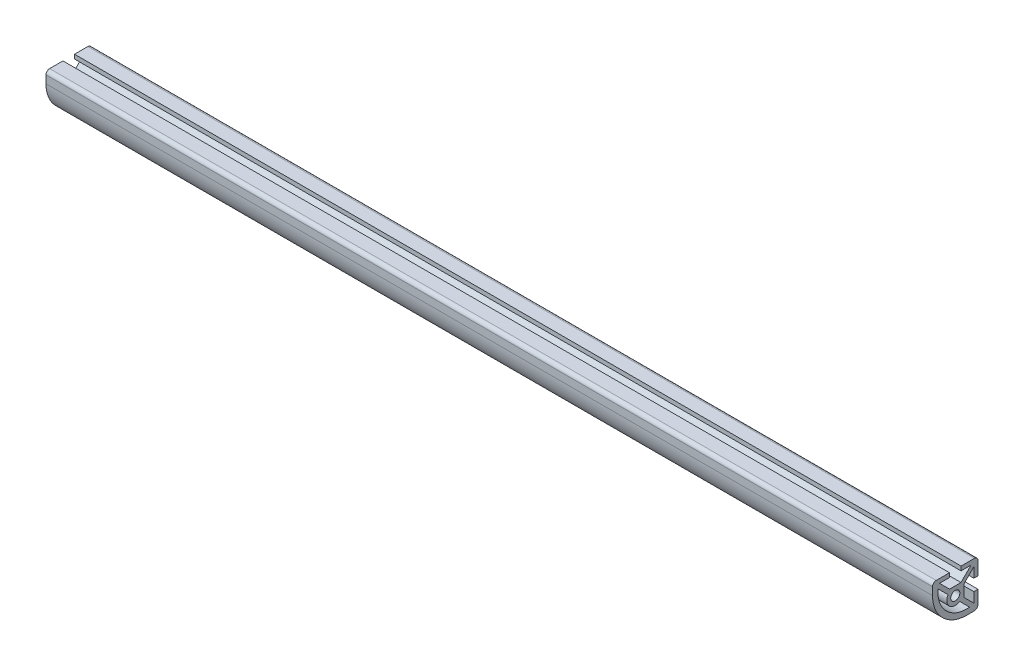
ISO-10303-21;
HEADER;
FILE_DESCRIPTION(('STEP AP214'),'2;1');
FILE_NAME('part.step','',(''),(''),'','','');
FILE_SCHEMA(('AUTOMOTIVE_DESIGN { 1 0 10303 214 1 1 1 1 }'));
ENDSEC;
DATA;
#1=APPLICATION_CONTEXT('core data for automotive mechanical design processes');
#2=APPLICATION_PROTOCOL_DEFINITION('international standard','automotive_design',2000,#1);
#3=PRODUCT_CONTEXT('',#1,'mechanical');
#4=PRODUCT('Part','Part','',(#3));
#5=PRODUCT_RELATED_PRODUCT_CATEGORY('part','',(#4));
#6=PRODUCT_DEFINITION_FORMATION('','',#4);
#7=PRODUCT_DEFINITION_CONTEXT('part definition',#1,'design');
#8=PRODUCT_DEFINITION('design','',#6,#7);
#9=PRODUCT_DEFINITION_SHAPE('','',#8);
#10=(LENGTH_UNIT() NAMED_UNIT(*) SI_UNIT(.MILLI.,.METRE.));
#11=(NAMED_UNIT(*) PLANE_ANGLE_UNIT() SI_UNIT($,.RADIAN.));
#12=(NAMED_UNIT(*) SI_UNIT($,.STERADIAN.) SOLID_ANGLE_UNIT());
#13=UNCERTAINTY_MEASURE_WITH_UNIT(LENGTH_MEASURE(1.E-05),#10,'distance_accuracy_value','');
#14=(GEOMETRIC_REPRESENTATION_CONTEXT(3) GLOBAL_UNCERTAINTY_ASSIGNED_CONTEXT((#13)) GLOBAL_UNIT_ASSIGNED_CONTEXT((#10,
#11,#12)) REPRESENTATION_CONTEXT('',''));
#15=CARTESIAN_POINT('',(0.,0.,0.));
#16=DIRECTION('',(0.,0.,1.));
#17=DIRECTION('',(1.,0.,0.));
#18=AXIS2_PLACEMENT_3D('',#15,#16,#17);
#19=CARTESIAN_POINT('',(247.65,10.668,10.6679999999999));
#20=DIRECTION('',(-1.,0.,0.));
#21=DIRECTION('',(0.,0.,1.));
#22=AXIS2_PLACEMENT_3D('',#19,#20,#21);
#23=PLANE('',#22);
#24=CARTESIAN_POINT('',(247.65,10.668,10.6679999999999));
#25=DIRECTION('',(1.,0.,0.));
#26=DIRECTION('',(0.,0.,1.));
#27=AXIS2_PLACEMENT_3D('',#24,#25,#26);
#28=CIRCLE('',#27,2.03200000000002);
#29=CARTESIAN_POINT('',(247.65,12.7,10.6679999999999));
#30=VERTEX_POINT('',#29);
#31=CARTESIAN_POINT('',(247.65,10.668,12.6999999999999));
#32=VERTEX_POINT('',#31);
#33=EDGE_CURVE('E228',#30,#32,#28,.T.);
#34=ORIENTED_EDGE('',*,*,#33,.T.);
#35=DIRECTION('',(0.,-1.,0.));
#36=VECTOR('',#35,1.);
#37=CARTESIAN_POINT('',(247.65,10.668,12.6999999999999));
#38=LINE('',#37,#36);
#39=CARTESIAN_POINT('',(247.65,6.35000000000034,12.6999999999999));
#40=VERTEX_POINT('',#39);
#41=EDGE_CURVE('E337',#32,#40,#38,.T.);
#42=ORIENTED_EDGE('',*,*,#41,.T.);
#43=CARTESIAN_POINT('',(247.65,6.35,-6.35000000000011));
#44=DIRECTION('',(1.,0.,0.));
#45=DIRECTION('',(0.,0.,-1.));
#46=AXIS2_PLACEMENT_3D('',#43,#44,#45);
#47=CIRCLE('',#46,19.05);
#48=CARTESIAN_POINT('',(247.65,-12.7,-6.35000000000012));
#49=VERTEX_POINT('',#48);
#50=EDGE_CURVE('E339',#40,#49,#47,.T.);
#51=ORIENTED_EDGE('',*,*,#50,.T.);
#52=DIRECTION('',(0.,0.,-1.));
#53=VECTOR('',#52,1.);
#54=CARTESIAN_POINT('',(247.65,-12.7,-10.6679999999999));
#55=LINE('',#54,#53);
#56=CARTESIAN_POINT('',(247.65,-12.7,-10.6679999999999));
#57=VERTEX_POINT('',#56);
#58=EDGE_CURVE('E341',#49,#57,#55,.T.);
#59=ORIENTED_EDGE('',*,*,#58,.T.);
#60=CARTESIAN_POINT('',(247.65,-10.668,-10.6679999999999));
#61=DIRECTION('',(1.,0.,0.));
#62=DIRECTION('',(0.,0.,1.));
#63=AXIS2_PLACEMENT_3D('',#60,#61,#62);
#64=CIRCLE('',#63,2.03200000000001);
#65=CARTESIAN_POINT('',(247.65,-10.668,-12.6999999999999));
#66=VERTEX_POINT('',#65);
#67=EDGE_CURVE('E343',#57,#66,#64,.T.);
#68=ORIENTED_EDGE('',*,*,#67,.T.);
#69=DIRECTION('',(0.,1.,0.));
#70=VECTOR('',#69,1.);
#71=CARTESIAN_POINT('',(247.65,-3.23850000000069,-12.6999999999999));
#72=LINE('',#71,#70);
#73=CARTESIAN_POINT('',(247.65,-3.23850000000069,-12.6999999999999));
#74=VERTEX_POINT('',#73);
#75=EDGE_CURVE('E345',#66,#74,#72,.T.);
#76=ORIENTED_EDGE('',*,*,#75,.T.);
#77=DIRECTION('',(0.,0.,1.));
#78=VECTOR('',#77,1.);
#79=CARTESIAN_POINT('',(247.65,-3.23850000000054,-10.3632000000016));
#80=LINE('',#79,#78);
#81=CARTESIAN_POINT('',(247.65,-3.23850000000054,-10.3632000000016));
#82=VERTEX_POINT('',#81);
#83=EDGE_CURVE('E347',#74,#82,#80,.T.);
#84=ORIENTED_EDGE('',*,*,#83,.T.);
#85=DIRECTION('',(0.,-1.,0.));
#86=VECTOR('',#85,1.);
#87=CARTESIAN_POINT('',(247.65,-8.80063543493584,-10.3632000000016));
#88=LINE('',#87,#86);
#89=CARTESIAN_POINT('',(247.65,-8.80063543493584,-10.3632000000016));
#90=VERTEX_POINT('',#89);
#91=EDGE_CURVE('E349',#82,#90,#88,.T.);
#92=ORIENTED_EDGE('',*,*,#91,.T.);
#93=DIRECTION('',(0.,0.707106781186543,0.707106781186552));
#94=VECTOR('',#93,1.);
#95=CARTESIAN_POINT('',(247.65,-3.18723566949115,-4.74980023455686));
#96=LINE('',#95,#94);
#97=CARTESIAN_POINT('',(247.65,-3.18723566949115,-4.74980023455686));
#98=VERTEX_POINT('',#97);
#99=EDGE_CURVE('E351',#90,#98,#96,.T.);
#100=ORIENTED_EDGE('',*,*,#99,.T.);
#101=DIRECTION('',(0.,1.,0.));
#102=VECTOR('',#101,1.);
#103=CARTESIAN_POINT('',(247.65,3.18723566949115,-4.74980023455665));
#104=LINE('',#103,#102);
#105=CARTESIAN_POINT('',(247.65,3.18723566949115,-4.74980023455665));
#106=VERTEX_POINT('',#105);
#107=EDGE_CURVE('E353',#98,#106,#104,.T.);
#108=ORIENTED_EDGE('',*,*,#107,.T.);
#109=DIRECTION('',(0.,0.707106781186543,-0.707106781186552));
#110=VECTOR('',#109,1.);
#111=CARTESIAN_POINT('',(247.65,8.80063543493585,-10.3632000000014));
#112=LINE('',#111,#110);
#113=CARTESIAN_POINT('',(247.65,8.80063543493585,-10.3632000000014));
#114=VERTEX_POINT('',#113);
#115=EDGE_CURVE('E355',#106,#114,#112,.T.);
#116=ORIENTED_EDGE('',*,*,#115,.T.);
#117=DIRECTION('',(0.,-1.,0.));
#118=VECTOR('',#117,1.);
#119=CARTESIAN_POINT('',(247.65,3.23850000000055,-10.3632000000014));
#120=LINE('',#119,#118);
#121=CARTESIAN_POINT('',(247.65,3.23850000000055,-10.3632000000014));
#122=VERTEX_POINT('',#121);
#123=EDGE_CURVE('E357',#114,#122,#120,.T.);
#124=ORIENTED_EDGE('',*,*,#123,.T.);
#125=DIRECTION('',(0.,0.,-1.));
#126=VECTOR('',#125,1.);
#127=CARTESIAN_POINT('',(247.65,3.23850000000069,-12.7));
#128=LINE('',#127,#126);
#129=CARTESIAN_POINT('',(247.65,3.23850000000069,-12.7));
#130=VERTEX_POINT('',#129);
#131=EDGE_CURVE('E359',#122,#130,#128,.T.);
#132=ORIENTED_EDGE('',*,*,#131,.T.);
#133=DIRECTION('',(0.,1.,0.));
#134=VECTOR('',#133,1.);
#135=CARTESIAN_POINT('',(247.65,10.668,-12.7));
#136=LINE('',#135,#134);
#137=CARTESIAN_POINT('',(247.65,10.668,-12.7));
#138=VERTEX_POINT('',#137);
#139=EDGE_CURVE('E361',#130,#138,#136,.T.);
#140=ORIENTED_EDGE('',*,*,#139,.T.);
#141=CARTESIAN_POINT('',(247.65,10.668,-10.668));
#142=DIRECTION('',(1.,0.,0.));
#143=DIRECTION('',(0.,0.,1.));
#144=AXIS2_PLACEMENT_3D('',#141,#142,#143);
#145=CIRCLE('',#144,2.03200000000001);
#146=CARTESIAN_POINT('',(247.65,12.7,-10.668));
#147=VERTEX_POINT('',#146);
#148=EDGE_CURVE('E363',#138,#147,#145,.T.);
#149=ORIENTED_EDGE('',*,*,#148,.T.);
#150=DIRECTION('',(0.,0.,1.));
#151=VECTOR('',#150,1.);
#152=CARTESIAN_POINT('',(247.65,12.7,-3.23850000000062));
#153=LINE('',#152,#151);
#154=CARTESIAN_POINT('',(247.65,12.7,-3.23850000000062));
#155=VERTEX_POINT('',#154);
#156=EDGE_CURVE('E365',#147,#155,#153,.T.);
#157=ORIENTED_EDGE('',*,*,#156,.T.);
#158=DIRECTION('',(0.,-1.,0.));
#159=VECTOR('',#158,1.);
#160=CARTESIAN_POINT('',(247.65,10.3632000000014,-3.23850000000062));
#161=LINE('',#160,#159);
#162=CARTESIAN_POINT('',(247.65,10.3632000000014,-3.23850000000062));
#163=VERTEX_POINT('',#162);
#164=EDGE_CURVE('E367',#155,#163,#161,.T.);
#165=ORIENTED_EDGE('',*,*,#164,.T.);
#166=DIRECTION('',(0.,0.,-1.));
#167=VECTOR('',#166,1.);
#168=CARTESIAN_POINT('',(247.65,10.3632000000014,-8.80063543493592));
#169=LINE('',#168,#167);
#170=CARTESIAN_POINT('',(247.65,10.3632000000014,-8.80063543493592));
#171=VERTEX_POINT('',#170);
#172=EDGE_CURVE('E369',#163,#171,#169,.T.);
#173=ORIENTED_EDGE('',*,*,#172,.T.);
#174=DIRECTION('',(0.,-0.707106781186537,0.707106781186558));
#175=VECTOR('',#174,1.);
#176=CARTESIAN_POINT('',(247.65,4.74980023455676,-3.18723566949106));
#177=LINE('',#176,#175);
#178=CARTESIAN_POINT('',(247.65,4.74980023455676,-3.18723566949106));
#179=VERTEX_POINT('',#178);
#180=EDGE_CURVE('E371',#171,#179,#177,.T.);
#181=ORIENTED_EDGE('',*,*,#180,.T.);
#182=DIRECTION('',(0.,0.,1.));
#183=VECTOR('',#182,1.);
#184=CARTESIAN_POINT('',(247.65,4.74980023455676,3.18723566949115));
#185=LINE('',#184,#183);
#186=CARTESIAN_POINT('',(247.65,4.74980023455676,3.18723566949115));
#187=VERTEX_POINT('',#186);
#188=EDGE_CURVE('E373',#179,#187,#185,.T.);
#189=ORIENTED_EDGE('',*,*,#188,.T.);
#190=DIRECTION('',(0.,0.707106781186543,0.707106781186552));
#191=VECTOR('',#190,1.);
#192=CARTESIAN_POINT('',(247.65,10.3632000000014,8.80063543493592));
#193=LINE('',#192,#191);
#194=CARTESIAN_POINT('',(247.65,10.3632000000014,8.80063543493592));
#195=VERTEX_POINT('',#194);
#196=EDGE_CURVE('E375',#187,#195,#193,.T.);
#197=ORIENTED_EDGE('',*,*,#196,.T.);
#198=DIRECTION('',(0.,0.,-1.));
#199=VECTOR('',#198,1.);
#200=CARTESIAN_POINT('',(247.65,10.3632000000014,3.23850000000062));
#201=LINE('',#200,#199);
#202=CARTESIAN_POINT('',(247.65,10.3632000000014,3.23850000000062));
#203=VERTEX_POINT('',#202);
#204=EDGE_CURVE('E377',#195,#203,#201,.T.);
#205=ORIENTED_EDGE('',*,*,#204,.T.);
#206=DIRECTION('',(0.,1.,0.));
#207=VECTOR('',#206,1.);
#208=CARTESIAN_POINT('',(247.65,12.7,3.23850000000062));
#209=LINE('',#208,#207);
#210=CARTESIAN_POINT('',(247.65,12.7,3.23850000000062));
#211=VERTEX_POINT('',#210);
#212=EDGE_CURVE('E379',#203,#211,#209,.T.);
#213=ORIENTED_EDGE('',*,*,#212,.T.);
#214=DIRECTION('',(0.,0.,1.));
#215=VECTOR('',#214,1.);
#216=CARTESIAN_POINT('',(247.65,12.7,10.6679999999999));
#217=LINE('',#216,#215);
#218=EDGE_CURVE('E55',#211,#30,#217,.T.);
#219=ORIENTED_EDGE('',*,*,#218,.T.);
#220=EDGE_LOOP('',(#34,#42,#51,#59,#68,#76,#84,#92,#100,#108,#116,#124,#132,#140,#149,#157,#165,
#173,#181,#189,#197,#205,#213,#219));
#221=FACE_BOUND('',#220,.T.);
#222=CARTESIAN_POINT('',(247.65,0.,0.));
#223=DIRECTION('',(-1.,0.,0.));
#224=DIRECTION('',(0.,0.,-1.));
#225=AXIS2_PLACEMENT_3D('',#222,#223,#224);
#226=CIRCLE('',#225,4.74980023455676);
#227=CARTESIAN_POINT('',(247.65,-4.04776343648096,-2.48519887141517));
#228=VERTEX_POINT('',#227);
#229=CARTESIAN_POINT('',(247.65,2.48519887141525,4.04776343648091));
#230=VERTEX_POINT('',#229);
#231=EDGE_CURVE('E225',#228,#230,#226,.T.);
#232=ORIENTED_EDGE('',*,*,#231,.F.);
#233=DIRECTION('',(0.,0.707106781186554,0.707106781186541));
#234=VECTOR('',#233,1.);
#235=CARTESIAN_POINT('',(247.65,-4.04776343648096,-2.48519887141517));
#236=LINE('',#235,#234);
#237=CARTESIAN_POINT('',(247.65,-9.56631586282329,-8.00375129775741));
#238=VERTEX_POINT('',#237);
#239=EDGE_CURVE('E330',#238,#228,#236,.T.);
#240=ORIENTED_EDGE('',*,*,#239,.F.);
#241=CARTESIAN_POINT('',(247.65,6.34999999999999,-6.35000000000011));
#242=DIRECTION('',(1.,0.,0.));
#243=DIRECTION('',(0.,0.,-1.));
#244=AXIS2_PLACEMENT_3D('',#241,#242,#243);
#245=CIRCLE('',#244,16.0019999999998);
#246=CARTESIAN_POINT('',(247.65,8.00375129775759,9.56631586282315));
#247=VERTEX_POINT('',#246);
#248=EDGE_CURVE('E328',#247,#238,#245,.T.);
#249=ORIENTED_EDGE('',*,*,#248,.F.);
#250=DIRECTION('',(0.,0.707106781186554,0.707106781186541));
#251=VECTOR('',#250,1.);
#252=CARTESIAN_POINT('',(247.65,8.00375129775759,9.56631586282315));
#253=LINE('',#252,#251);
#254=EDGE_CURVE('E326',#230,#247,#253,.T.);
#255=ORIENTED_EDGE('',*,*,#254,.F.);
#256=EDGE_LOOP('',(#232,#240,#249,#255));
#257=FACE_BOUND('',#256,.T.);
#258=CARTESIAN_POINT('',(247.65,0.,0.));
#259=DIRECTION('',(1.,0.,0.));
#260=DIRECTION('',(0.,0.,-1.));
#261=AXIS2_PLACEMENT_3D('',#258,#259,#260);
#262=CIRCLE('',#261,2.55269999999991);
#263=CARTESIAN_POINT('',(247.65,0.,-2.55269999999991));
#264=VERTEX_POINT('',#263);
#265=EDGE_CURVE('E322',#264,#264,#262,.T.);
#266=ORIENTED_EDGE('',*,*,#265,.F.);
#267=EDGE_LOOP('',(#266));
#268=FACE_BOUND('',#267,.T.);
#269=ADVANCED_FACE('F32',(#221,#257,#268),#23,.F.);
#270=CARTESIAN_POINT('',(247.65,10.668,10.6679999999999));
#271=DIRECTION('',(-1.,0.,0.));
#272=DIRECTION('',(0.,0.,1.));
#273=AXIS2_PLACEMENT_3D('',#270,#271,#272);
#274=CYLINDRICAL_SURFACE('',#273,2.03200000000002);
#275=DIRECTION('',(-1.,0.,0.));
#276=VECTOR('',#275,1.);
#277=CARTESIAN_POINT('',(247.65,12.7,10.6679999999999));
#278=LINE('',#277,#276);
#279=CARTESIAN_POINT('',(-247.65,12.7,10.6679999999999));
#280=VERTEX_POINT('',#279);
#281=EDGE_CURVE('E382',#30,#280,#278,.T.);
#282=ORIENTED_EDGE('',*,*,#281,.T.);
#283=CARTESIAN_POINT('',(-247.65,10.668,10.6679999999999));
#284=DIRECTION('',(1.,0.,0.));
#285=DIRECTION('',(0.,0.,1.));
#286=AXIS2_PLACEMENT_3D('',#283,#284,#285);
#287=CIRCLE('',#286,2.03200000000002);
#288=CARTESIAN_POINT('',(-247.65,10.668,12.6999999999999));
#289=VERTEX_POINT('',#288);
#290=EDGE_CURVE('E250',#280,#289,#287,.T.);
#291=ORIENTED_EDGE('',*,*,#290,.T.);
#292=DIRECTION('',(-1.,0.,0.));
#293=VECTOR('',#292,1.);
#294=CARTESIAN_POINT('',(247.65,10.668,12.6999999999999));
#295=LINE('',#294,#293);
#296=EDGE_CURVE('E11',#32,#289,#295,.T.);
#297=ORIENTED_EDGE('',*,*,#296,.F.);
#298=ORIENTED_EDGE('',*,*,#33,.F.);
#299=EDGE_LOOP('',(#282,#291,#297,#298));
#300=FACE_BOUND('',#299,.T.);
#301=ADVANCED_FACE('F34',(#300),#274,.T.);
#302=CARTESIAN_POINT('',(247.65,10.668,12.6999999999999));
#303=DIRECTION('',(0.,0.,-1.));
#304=DIRECTION('',(-1.,0.,0.));
#305=AXIS2_PLACEMENT_3D('',#302,#303,#304);
#306=PLANE('',#305);
#307=ORIENTED_EDGE('',*,*,#296,.T.);
#308=DIRECTION('',(0.,-1.,0.));
#309=VECTOR('',#308,1.);
#310=CARTESIAN_POINT('',(-247.65,10.668,12.6999999999999));
#311=LINE('',#310,#309);
#312=CARTESIAN_POINT('',(-247.65,6.35000000000034,12.6999999999999));
#313=VERTEX_POINT('',#312);
#314=EDGE_CURVE('E253',#289,#313,#311,.T.);
#315=ORIENTED_EDGE('',*,*,#314,.T.);
#316=DIRECTION('',(-1.,0.,0.));
#317=VECTOR('',#316,1.);
#318=CARTESIAN_POINT('',(247.65,6.35000000000034,12.6999999999999));
#319=LINE('',#318,#317);
#320=EDGE_CURVE('E40',#40,#313,#319,.T.);
#321=ORIENTED_EDGE('',*,*,#320,.F.);
#322=ORIENTED_EDGE('',*,*,#41,.F.);
#323=EDGE_LOOP('',(#307,#315,#321,#322));
#324=FACE_BOUND('',#323,.T.);
#325=ADVANCED_FACE('F436',(#324),#306,.F.);
#326=CARTESIAN_POINT('',(247.65,6.35,-6.35000000000011));
#327=DIRECTION('',(-1.,0.,0.));
#328=DIRECTION('',(0.,0.,1.));
#329=AXIS2_PLACEMENT_3D('',#326,#327,#328);
#330=CYLINDRICAL_SURFACE('',#329,19.05);
#331=ORIENTED_EDGE('',*,*,#320,.T.);
#332=CARTESIAN_POINT('',(-247.65,6.35,-6.35000000000011));
#333=DIRECTION('',(1.,0.,0.));
#334=DIRECTION('',(0.,0.,-1.));
#335=AXIS2_PLACEMENT_3D('',#332,#333,#334);
#336=CIRCLE('',#335,19.05);
#337=CARTESIAN_POINT('',(-247.65,-12.7,-6.35000000000012));
#338=VERTEX_POINT('',#337);
#339=EDGE_CURVE('E256',#313,#338,#336,.T.);
#340=ORIENTED_EDGE('',*,*,#339,.T.);
#341=DIRECTION('',(-1.,0.,0.));
#342=VECTOR('',#341,1.);
#343=CARTESIAN_POINT('',(247.65,-12.7,-6.35000000000012));
#344=LINE('',#343,#342);
#345=EDGE_CURVE('E424',#49,#338,#344,.T.);
#346=ORIENTED_EDGE('',*,*,#345,.F.);
#347=ORIENTED_EDGE('',*,*,#50,.F.);
#348=EDGE_LOOP('',(#331,#340,#346,#347));
#349=FACE_BOUND('',#348,.T.);
#350=ADVANCED_FACE('F429',(#349),#330,.T.);
#351=CARTESIAN_POINT('',(247.65,-12.7,-10.6679999999999));
#352=DIRECTION('',(0.,1.,0.));
#353=DIRECTION('',(0.,0.,1.));
#354=AXIS2_PLACEMENT_3D('',#351,#352,#353);
#355=PLANE('',#354);
#356=ORIENTED_EDGE('',*,*,#345,.T.);
#357=DIRECTION('',(0.,0.,-1.));
#358=VECTOR('',#357,1.);
#359=CARTESIAN_POINT('',(-247.65,-12.7,-10.6679999999999));
#360=LINE('',#359,#358);
#361=CARTESIAN_POINT('',(-247.65,-12.7,-10.6679999999999));
#362=VERTEX_POINT('',#361);
#363=EDGE_CURVE('E259',#338,#362,#360,.T.);
#364=ORIENTED_EDGE('',*,*,#363,.T.);
#365=DIRECTION('',(-1.,0.,0.));
#366=VECTOR('',#365,1.);
#367=CARTESIAN_POINT('',(247.65,-12.7,-10.6679999999999));
#368=LINE('',#367,#366);
#369=EDGE_CURVE('E422',#57,#362,#368,.T.);
#370=ORIENTED_EDGE('',*,*,#369,.F.);
#371=ORIENTED_EDGE('',*,*,#58,.F.);
#372=EDGE_LOOP('',(#356,#364,#370,#371));
#373=FACE_BOUND('',#372,.T.);
#374=ADVANCED_FACE('F539',(#373),#355,.F.);
#375=CARTESIAN_POINT('',(247.65,-10.668,-10.6679999999999));
#376=DIRECTION('',(-1.,0.,0.));
#377=DIRECTION('',(0.,0.,1.));
#378=AXIS2_PLACEMENT_3D('',#375,#376,#377);
#379=CYLINDRICAL_SURFACE('',#378,2.03200000000001);
#380=ORIENTED_EDGE('',*,*,#369,.T.);
#381=CARTESIAN_POINT('',(-247.65,-10.668,-10.6679999999999));
#382=DIRECTION('',(1.,0.,0.));
#383=DIRECTION('',(0.,0.,1.));
#384=AXIS2_PLACEMENT_3D('',#381,#382,#383);
#385=CIRCLE('',#384,2.03200000000001);
#386=CARTESIAN_POINT('',(-247.65,-10.668,-12.6999999999999));
#387=VERTEX_POINT('',#386);
#388=EDGE_CURVE('E262',#362,#387,#385,.T.);
#389=ORIENTED_EDGE('',*,*,#388,.T.);
#390=DIRECTION('',(-1.,0.,0.));
#391=VECTOR('',#390,1.);
#392=CARTESIAN_POINT('',(247.65,-10.668,-12.6999999999999));
#393=LINE('',#392,#391);
#394=EDGE_CURVE('E420',#66,#387,#393,.T.);
#395=ORIENTED_EDGE('',*,*,#394,.F.);
#396=ORIENTED_EDGE('',*,*,#67,.F.);
#397=EDGE_LOOP('',(#380,#389,#395,#396));
#398=FACE_BOUND('',#397,.T.);
#399=ADVANCED_FACE('F536',(#398),#379,.T.);
#400=CARTESIAN_POINT('',(247.65,-3.23850000000069,-12.6999999999999));
#401=DIRECTION('',(0.,0.,1.));
#402=DIRECTION('',(1.,0.,0.));
#403=AXIS2_PLACEMENT_3D('',#400,#401,#402);
#404=PLANE('',#403);
#405=ORIENTED_EDGE('',*,*,#394,.T.);
#406=DIRECTION('',(0.,1.,0.));
#407=VECTOR('',#406,1.);
#408=CARTESIAN_POINT('',(-247.65,-3.23850000000069,-12.6999999999999));
#409=LINE('',#408,#407);
#410=CARTESIAN_POINT('',(-247.65,-3.23850000000069,-12.6999999999999));
#411=VERTEX_POINT('',#410);
#412=EDGE_CURVE('E265',#387,#411,#409,.T.);
#413=ORIENTED_EDGE('',*,*,#412,.T.);
#414=DIRECTION('',(-1.,0.,0.));
#415=VECTOR('',#414,1.);
#416=CARTESIAN_POINT('',(247.65,-3.23850000000069,-12.6999999999999));
#417=LINE('',#416,#415);
#418=EDGE_CURVE('E418',#74,#411,#417,.T.);
#419=ORIENTED_EDGE('',*,*,#418,.F.);
#420=ORIENTED_EDGE('',*,*,#75,.F.);
#421=EDGE_LOOP('',(#405,#413,#419,#420));
#422=FACE_BOUND('',#421,.T.);
#423=ADVANCED_FACE('F531',(#422),#404,.F.);
#424=CARTESIAN_POINT('',(247.65,-3.23850000000054,-10.3632000000016));
#425=DIRECTION('',(0.,-1.,0.));
#426=DIRECTION('',(0.,0.,-1.));
#427=AXIS2_PLACEMENT_3D('',#424,#425,#426);
#428=PLANE('',#427);
#429=ORIENTED_EDGE('',*,*,#418,.T.);
#430=DIRECTION('',(0.,0.,1.));
#431=VECTOR('',#430,1.);
#432=CARTESIAN_POINT('',(-247.65,-3.23850000000054,-10.3632000000016));
#433=LINE('',#432,#431);
#434=CARTESIAN_POINT('',(-247.65,-3.23850000000054,-10.3632000000016));
#435=VERTEX_POINT('',#434);
#436=EDGE_CURVE('E268',#411,#435,#433,.T.);
#437=ORIENTED_EDGE('',*,*,#436,.T.);
#438=DIRECTION('',(-1.,0.,0.));
#439=VECTOR('',#438,1.);
#440=CARTESIAN_POINT('',(247.65,-3.23850000000054,-10.3632000000016));
#441=LINE('',#440,#439);
#442=EDGE_CURVE('E416',#82,#435,#441,.T.);
#443=ORIENTED_EDGE('',*,*,#442,.F.);
#444=ORIENTED_EDGE('',*,*,#83,.F.);
#445=EDGE_LOOP('',(#429,#437,#443,#444));
#446=FACE_BOUND('',#445,.T.);
#447=ADVANCED_FACE('F527',(#446),#428,.F.);
#448=CARTESIAN_POINT('',(247.65,-8.80063543493584,-10.3632000000016));
#449=DIRECTION('',(0.,0.,-1.));
#450=DIRECTION('',(-1.,0.,0.));
#451=AXIS2_PLACEMENT_3D('',#448,#449,#450);
#452=PLANE('',#451);
#453=ORIENTED_EDGE('',*,*,#442,.T.);
#454=DIRECTION('',(0.,-1.,0.));
#455=VECTOR('',#454,1.);
#456=CARTESIAN_POINT('',(-247.65,-8.80063543493584,-10.3632000000016));
#457=LINE('',#456,#455);
#458=CARTESIAN_POINT('',(-247.65,-8.80063543493584,-10.3632000000016));
#459=VERTEX_POINT('',#458);
#460=EDGE_CURVE('E271',#435,#459,#457,.T.);
#461=ORIENTED_EDGE('',*,*,#460,.T.);
#462=DIRECTION('',(-1.,0.,0.));
#463=VECTOR('',#462,1.);
#464=CARTESIAN_POINT('',(247.65,-8.80063543493584,-10.3632000000016));
#465=LINE('',#464,#463);
#466=EDGE_CURVE('E414',#90,#459,#465,.T.);
#467=ORIENTED_EDGE('',*,*,#466,.F.);
#468=ORIENTED_EDGE('',*,*,#91,.F.);
#469=EDGE_LOOP('',(#453,#461,#467,#468));
#470=FACE_BOUND('',#469,.T.);
#471=ADVANCED_FACE('F522',(#470),#452,.F.);
#472=CARTESIAN_POINT('',(247.65,-3.18723566949115,-4.74980023455686));
#473=DIRECTION('',(0.,-0.707106781186552,0.707106781186543));
#474=DIRECTION('',(0.,-0.707106781186543,-0.707106781186552));
#475=AXIS2_PLACEMENT_3D('',#472,#473,#474);
#476=PLANE('',#475);
#477=ORIENTED_EDGE('',*,*,#466,.T.);
#478=DIRECTION('',(0.,0.707106781186543,0.707106781186552));
#479=VECTOR('',#478,1.);
#480=CARTESIAN_POINT('',(-247.65,-3.18723566949115,-4.74980023455686));
#481=LINE('',#480,#479);
#482=CARTESIAN_POINT('',(-247.65,-3.18723566949115,-4.74980023455686));
#483=VERTEX_POINT('',#482);
#484=EDGE_CURVE('E274',#459,#483,#481,.T.);
#485=ORIENTED_EDGE('',*,*,#484,.T.);
#486=DIRECTION('',(-1.,0.,0.));
#487=VECTOR('',#486,1.);
#488=CARTESIAN_POINT('',(247.65,-3.18723566949115,-4.74980023455686));
#489=LINE('',#488,#487);
#490=EDGE_CURVE('E412',#98,#483,#489,.T.);
#491=ORIENTED_EDGE('',*,*,#490,.F.);
#492=ORIENTED_EDGE('',*,*,#99,.F.);
#493=EDGE_LOOP('',(#477,#485,#491,#492));
#494=FACE_BOUND('',#493,.T.);
#495=ADVANCED_FACE('F517',(#494),#476,.F.);
#496=CARTESIAN_POINT('',(247.65,3.18723566949115,-4.74980023455665));
#497=DIRECTION('',(0.,0.,1.));
#498=DIRECTION('',(0.,-1.,0.));
#499=AXIS2_PLACEMENT_3D('',#496,#497,#498);
#500=PLANE('',#499);
#501=ORIENTED_EDGE('',*,*,#490,.T.);
#502=DIRECTION('',(0.,1.,0.));
#503=VECTOR('',#502,1.);
#504=CARTESIAN_POINT('',(-247.65,3.18723566949115,-4.74980023455665));
#505=LINE('',#504,#503);
#506=CARTESIAN_POINT('',(-247.65,3.18723566949115,-4.74980023455665));
#507=VERTEX_POINT('',#506);
#508=EDGE_CURVE('E277',#483,#507,#505,.T.);
#509=ORIENTED_EDGE('',*,*,#508,.T.);
#510=DIRECTION('',(-1.,0.,0.));
#511=VECTOR('',#510,1.);
#512=CARTESIAN_POINT('',(247.65,3.18723566949115,-4.74980023455665));
#513=LINE('',#512,#511);
#514=EDGE_CURVE('E410',#106,#507,#513,.T.);
#515=ORIENTED_EDGE('',*,*,#514,.F.);
#516=ORIENTED_EDGE('',*,*,#107,.F.);
#517=EDGE_LOOP('',(#501,#509,#515,#516));
#518=FACE_BOUND('',#517,.T.);
#519=ADVANCED_FACE('F512',(#518),#500,.F.);
#520=CARTESIAN_POINT('',(247.65,8.80063543493585,-10.3632000000014));
#521=DIRECTION('',(0.,0.707106781186552,0.707106781186543));
#522=DIRECTION('',(0.,-0.707106781186543,0.707106781186552));
#523=AXIS2_PLACEMENT_3D('',#520,#521,#522);
#524=PLANE('',#523);
#525=ORIENTED_EDGE('',*,*,#514,.T.);
#526=DIRECTION('',(0.,0.707106781186543,-0.707106781186552));
#527=VECTOR('',#526,1.);
#528=CARTESIAN_POINT('',(-247.65,8.80063543493585,-10.3632000000014));
#529=LINE('',#528,#527);
#530=CARTESIAN_POINT('',(-247.65,8.80063543493585,-10.3632000000014));
#531=VERTEX_POINT('',#530);
#532=EDGE_CURVE('E280',#507,#531,#529,.T.);
#533=ORIENTED_EDGE('',*,*,#532,.T.);
#534=DIRECTION('',(-1.,0.,0.));
#535=VECTOR('',#534,1.);
#536=CARTESIAN_POINT('',(247.65,8.80063543493585,-10.3632000000014));
#537=LINE('',#536,#535);
#538=EDGE_CURVE('E408',#114,#531,#537,.T.);
#539=ORIENTED_EDGE('',*,*,#538,.F.);
#540=ORIENTED_EDGE('',*,*,#115,.F.);
#541=EDGE_LOOP('',(#525,#533,#539,#540));
#542=FACE_BOUND('',#541,.T.);
#543=ADVANCED_FACE('F507',(#542),#524,.F.);
#544=CARTESIAN_POINT('',(247.65,3.23850000000055,-10.3632000000014));
#545=DIRECTION('',(0.,0.,-1.));
#546=DIRECTION('',(-1.,0.,0.));
#547=AXIS2_PLACEMENT_3D('',#544,#545,#546);
#548=PLANE('',#547);
#549=ORIENTED_EDGE('',*,*,#538,.T.);
#550=DIRECTION('',(0.,-1.,0.));
#551=VECTOR('',#550,1.);
#552=CARTESIAN_POINT('',(-247.65,3.23850000000055,-10.3632000000014));
#553=LINE('',#552,#551);
#554=CARTESIAN_POINT('',(-247.65,3.23850000000055,-10.3632000000014));
#555=VERTEX_POINT('',#554);
#556=EDGE_CURVE('E283',#531,#555,#553,.T.);
#557=ORIENTED_EDGE('',*,*,#556,.T.);
#558=DIRECTION('',(-1.,0.,0.));
#559=VECTOR('',#558,1.);
#560=CARTESIAN_POINT('',(247.65,3.23850000000055,-10.3632000000014));
#561=LINE('',#560,#559);
#562=EDGE_CURVE('E406',#122,#555,#561,.T.);
#563=ORIENTED_EDGE('',*,*,#562,.F.);
#564=ORIENTED_EDGE('',*,*,#123,.F.);
#565=EDGE_LOOP('',(#549,#557,#563,#564));
#566=FACE_BOUND('',#565,.T.);
#567=ADVANCED_FACE('F502',(#566),#548,.F.);
#568=CARTESIAN_POINT('',(247.65,3.23850000000069,-12.7));
#569=DIRECTION('',(0.,1.,0.));
#570=DIRECTION('',(0.,0.,1.));
#571=AXIS2_PLACEMENT_3D('',#568,#569,#570);
#572=PLANE('',#571);
#573=ORIENTED_EDGE('',*,*,#562,.T.);
#574=DIRECTION('',(0.,0.,-1.));
#575=VECTOR('',#574,1.);
#576=CARTESIAN_POINT('',(-247.65,3.23850000000069,-12.7));
#577=LINE('',#576,#575);
#578=CARTESIAN_POINT('',(-247.65,3.23850000000069,-12.7));
#579=VERTEX_POINT('',#578);
#580=EDGE_CURVE('E286',#555,#579,#577,.T.);
#581=ORIENTED_EDGE('',*,*,#580,.T.);
#582=DIRECTION('',(-1.,0.,0.));
#583=VECTOR('',#582,1.);
#584=CARTESIAN_POINT('',(247.65,3.23850000000069,-12.7));
#585=LINE('',#584,#583);
#586=EDGE_CURVE('E404',#130,#579,#585,.T.);
#587=ORIENTED_EDGE('',*,*,#586,.F.);
#588=ORIENTED_EDGE('',*,*,#131,.F.);
#589=EDGE_LOOP('',(#573,#581,#587,#588));
#590=FACE_BOUND('',#589,.T.);
#591=ADVANCED_FACE('F497',(#590),#572,.F.);
#592=CARTESIAN_POINT('',(247.65,10.668,-12.7));
#593=DIRECTION('',(0.,0.,1.));
#594=DIRECTION('',(1.,0.,0.));
#595=AXIS2_PLACEMENT_3D('',#592,#593,#594);
#596=PLANE('',#595);
#597=ORIENTED_EDGE('',*,*,#586,.T.);
#598=DIRECTION('',(0.,1.,0.));
#599=VECTOR('',#598,1.);
#600=CARTESIAN_POINT('',(-247.65,10.668,-12.7));
#601=LINE('',#600,#599);
#602=CARTESIAN_POINT('',(-247.65,10.668,-12.7));
#603=VERTEX_POINT('',#602);
#604=EDGE_CURVE('E289',#579,#603,#601,.T.);
#605=ORIENTED_EDGE('',*,*,#604,.T.);
#606=DIRECTION('',(-1.,0.,0.));
#607=VECTOR('',#606,1.);
#608=CARTESIAN_POINT('',(247.65,10.668,-12.7));
#609=LINE('',#608,#607);
#610=EDGE_CURVE('E402',#138,#603,#609,.T.);
#611=ORIENTED_EDGE('',*,*,#610,.F.);
#612=ORIENTED_EDGE('',*,*,#139,.F.);
#613=EDGE_LOOP('',(#597,#605,#611,#612));
#614=FACE_BOUND('',#613,.T.);
#615=ADVANCED_FACE('F492',(#614),#596,.F.);
#616=CARTESIAN_POINT('',(247.65,10.668,-10.668));
#617=DIRECTION('',(-1.,0.,0.));
#618=DIRECTION('',(0.,0.,1.));
#619=AXIS2_PLACEMENT_3D('',#616,#617,#618);
#620=CYLINDRICAL_SURFACE('',#619,2.03200000000001);
#621=ORIENTED_EDGE('',*,*,#610,.T.);
#622=CARTESIAN_POINT('',(-247.65,10.668,-10.668));
#623=DIRECTION('',(1.,0.,0.));
#624=DIRECTION('',(0.,0.,1.));
#625=AXIS2_PLACEMENT_3D('',#622,#623,#624);
#626=CIRCLE('',#625,2.03200000000001);
#627=CARTESIAN_POINT('',(-247.65,12.7,-10.668));
#628=VERTEX_POINT('',#627);
#629=EDGE_CURVE('E292',#603,#628,#626,.T.);
#630=ORIENTED_EDGE('',*,*,#629,.T.);
#631=DIRECTION('',(-1.,0.,0.));
#632=VECTOR('',#631,1.);
#633=CARTESIAN_POINT('',(247.65,12.7,-10.668));
#634=LINE('',#633,#632);
#635=EDGE_CURVE('E400',#147,#628,#634,.T.);
#636=ORIENTED_EDGE('',*,*,#635,.F.);
#637=ORIENTED_EDGE('',*,*,#148,.F.);
#638=EDGE_LOOP('',(#621,#630,#636,#637));
#639=FACE_BOUND('',#638,.T.);
#640=ADVANCED_FACE('F487',(#639),#620,.T.);
#641=CARTESIAN_POINT('',(247.65,12.7,-3.23850000000062));
#642=DIRECTION('',(0.,-1.,0.));
#643=DIRECTION('',(0.,0.,-1.));
#644=AXIS2_PLACEMENT_3D('',#641,#642,#643);
#645=PLANE('',#644);
#646=ORIENTED_EDGE('',*,*,#635,.T.);
#647=DIRECTION('',(0.,0.,1.));
#648=VECTOR('',#647,1.);
#649=CARTESIAN_POINT('',(-247.65,12.7,-3.23850000000062));
#650=LINE('',#649,#648);
#651=CARTESIAN_POINT('',(-247.65,12.7,-3.23850000000062));
#652=VERTEX_POINT('',#651);
#653=EDGE_CURVE('E295',#628,#652,#650,.T.);
#654=ORIENTED_EDGE('',*,*,#653,.T.);
#655=DIRECTION('',(-1.,0.,0.));
#656=VECTOR('',#655,1.);
#657=CARTESIAN_POINT('',(247.65,12.7,-3.23850000000062));
#658=LINE('',#657,#656);
#659=EDGE_CURVE('E398',#155,#652,#658,.T.);
#660=ORIENTED_EDGE('',*,*,#659,.F.);
#661=ORIENTED_EDGE('',*,*,#156,.F.);
#662=EDGE_LOOP('',(#646,#654,#660,#661));
#663=FACE_BOUND('',#662,.T.);
#664=ADVANCED_FACE('F482',(#663),#645,.F.);
#665=CARTESIAN_POINT('',(247.65,10.3632000000014,-3.23850000000062));
#666=DIRECTION('',(0.,0.,-1.));
#667=DIRECTION('',(-1.,0.,0.));
#668=AXIS2_PLACEMENT_3D('',#665,#666,#667);
#669=PLANE('',#668);
#670=ORIENTED_EDGE('',*,*,#659,.T.);
#671=DIRECTION('',(0.,-1.,0.));
#672=VECTOR('',#671,1.);
#673=CARTESIAN_POINT('',(-247.65,10.3632000000014,-3.23850000000062));
#674=LINE('',#673,#672);
#675=CARTESIAN_POINT('',(-247.65,10.3632000000014,-3.23850000000062));
#676=VERTEX_POINT('',#675);
#677=EDGE_CURVE('E298',#652,#676,#674,.T.);
#678=ORIENTED_EDGE('',*,*,#677,.T.);
#679=DIRECTION('',(-1.,0.,0.));
#680=VECTOR('',#679,1.);
#681=CARTESIAN_POINT('',(247.65,10.3632000000014,-3.23850000000062));
#682=LINE('',#681,#680);
#683=EDGE_CURVE('E396',#163,#676,#682,.T.);
#684=ORIENTED_EDGE('',*,*,#683,.F.);
#685=ORIENTED_EDGE('',*,*,#164,.F.);
#686=EDGE_LOOP('',(#670,#678,#684,#685));
#687=FACE_BOUND('',#686,.T.);
#688=ADVANCED_FACE('F477',(#687),#669,.F.);
#689=CARTESIAN_POINT('',(247.65,10.3632000000014,-8.80063543493592));
#690=DIRECTION('',(0.,1.,0.));
#691=DIRECTION('',(0.,0.,1.));
#692=AXIS2_PLACEMENT_3D('',#689,#690,#691);
#693=PLANE('',#692);
#694=ORIENTED_EDGE('',*,*,#683,.T.);
#695=DIRECTION('',(0.,0.,-1.));
#696=VECTOR('',#695,1.);
#697=CARTESIAN_POINT('',(-247.65,10.3632000000014,-8.80063543493592));
#698=LINE('',#697,#696);
#699=CARTESIAN_POINT('',(-247.65,10.3632000000014,-8.80063543493592));
#700=VERTEX_POINT('',#699);
#701=EDGE_CURVE('E301',#676,#700,#698,.T.);
#702=ORIENTED_EDGE('',*,*,#701,.T.);
#703=DIRECTION('',(-1.,0.,0.));
#704=VECTOR('',#703,1.);
#705=CARTESIAN_POINT('',(247.65,10.3632000000014,-8.80063543493592));
#706=LINE('',#705,#704);
#707=EDGE_CURVE('E394',#171,#700,#706,.T.);
#708=ORIENTED_EDGE('',*,*,#707,.F.);
#709=ORIENTED_EDGE('',*,*,#172,.F.);
#710=EDGE_LOOP('',(#694,#702,#708,#709));
#711=FACE_BOUND('',#710,.T.);
#712=ADVANCED_FACE('F472',(#711),#693,.F.);
#713=CARTESIAN_POINT('',(247.65,4.74980023455676,-3.18723566949106));
#714=DIRECTION('',(0.,-0.707106781186558,-0.707106781186537));
#715=DIRECTION('',(0.,0.707106781186537,-0.707106781186558));
#716=AXIS2_PLACEMENT_3D('',#713,#714,#715);
#717=PLANE('',#716);
#718=ORIENTED_EDGE('',*,*,#707,.T.);
#719=DIRECTION('',(0.,-0.707106781186537,0.707106781186558));
#720=VECTOR('',#719,1.);
#721=CARTESIAN_POINT('',(-247.65,4.74980023455676,-3.18723566949106));
#722=LINE('',#721,#720);
#723=CARTESIAN_POINT('',(-247.65,4.74980023455676,-3.18723566949106));
#724=VERTEX_POINT('',#723);
#725=EDGE_CURVE('E304',#700,#724,#722,.T.);
#726=ORIENTED_EDGE('',*,*,#725,.T.);
#727=DIRECTION('',(-1.,0.,0.));
#728=VECTOR('',#727,1.);
#729=CARTESIAN_POINT('',(247.65,4.74980023455676,-3.18723566949106));
#730=LINE('',#729,#728);
#731=EDGE_CURVE('E392',#179,#724,#730,.T.);
#732=ORIENTED_EDGE('',*,*,#731,.F.);
#733=ORIENTED_EDGE('',*,*,#180,.F.);
#734=EDGE_LOOP('',(#718,#726,#732,#733));
#735=FACE_BOUND('',#734,.T.);
#736=ADVANCED_FACE('F467',(#735),#717,.F.);
#737=CARTESIAN_POINT('',(247.65,4.74980023455676,3.18723566949115));
#738=DIRECTION('',(0.,-1.,0.));
#739=DIRECTION('',(0.,0.,-1.));
#740=AXIS2_PLACEMENT_3D('',#737,#738,#739);
#741=PLANE('',#740);
#742=ORIENTED_EDGE('',*,*,#731,.T.);
#743=DIRECTION('',(0.,0.,1.));
#744=VECTOR('',#743,1.);
#745=CARTESIAN_POINT('',(-247.65,4.74980023455676,3.18723566949115));
#746=LINE('',#745,#744);
#747=CARTESIAN_POINT('',(-247.65,4.74980023455676,3.18723566949115));
#748=VERTEX_POINT('',#747);
#749=EDGE_CURVE('E307',#724,#748,#746,.T.);
#750=ORIENTED_EDGE('',*,*,#749,.T.);
#751=DIRECTION('',(-1.,0.,0.));
#752=VECTOR('',#751,1.);
#753=CARTESIAN_POINT('',(247.65,4.74980023455676,3.18723566949115));
#754=LINE('',#753,#752);
#755=EDGE_CURVE('E390',#187,#748,#754,.T.);
#756=ORIENTED_EDGE('',*,*,#755,.F.);
#757=ORIENTED_EDGE('',*,*,#188,.F.);
#758=EDGE_LOOP('',(#742,#750,#756,#757));
#759=FACE_BOUND('',#758,.T.);
#760=ADVANCED_FACE('F462',(#759),#741,.F.);
#761=CARTESIAN_POINT('',(247.65,10.3632000000014,8.80063543493592));
#762=DIRECTION('',(0.,-0.707106781186552,0.707106781186543));
#763=DIRECTION('',(0.,-0.707106781186543,-0.707106781186552));
#764=AXIS2_PLACEMENT_3D('',#761,#762,#763);
#765=PLANE('',#764);
#766=ORIENTED_EDGE('',*,*,#755,.T.);
#767=DIRECTION('',(0.,0.707106781186543,0.707106781186552));
#768=VECTOR('',#767,1.);
#769=CARTESIAN_POINT('',(-247.65,10.3632000000014,8.80063543493592));
#770=LINE('',#769,#768);
#771=CARTESIAN_POINT('',(-247.65,10.3632000000014,8.80063543493592));
#772=VERTEX_POINT('',#771);
#773=EDGE_CURVE('E310',#748,#772,#770,.T.);
#774=ORIENTED_EDGE('',*,*,#773,.T.);
#775=DIRECTION('',(-1.,0.,0.));
#776=VECTOR('',#775,1.);
#777=CARTESIAN_POINT('',(247.65,10.3632000000014,8.80063543493592));
#778=LINE('',#777,#776);
#779=EDGE_CURVE('E388',#195,#772,#778,.T.);
#780=ORIENTED_EDGE('',*,*,#779,.F.);
#781=ORIENTED_EDGE('',*,*,#196,.F.);
#782=EDGE_LOOP('',(#766,#774,#780,#781));
#783=FACE_BOUND('',#782,.T.);
#784=ADVANCED_FACE('F457',(#783),#765,.F.);
#785=CARTESIAN_POINT('',(247.65,10.3632000000014,3.23850000000062));
#786=DIRECTION('',(0.,1.,0.));
#787=DIRECTION('',(0.,0.,1.));
#788=AXIS2_PLACEMENT_3D('',#785,#786,#787);
#789=PLANE('',#788);
#790=ORIENTED_EDGE('',*,*,#779,.T.);
#791=DIRECTION('',(0.,0.,-1.));
#792=VECTOR('',#791,1.);
#793=CARTESIAN_POINT('',(-247.65,10.3632000000014,3.23850000000062));
#794=LINE('',#793,#792);
#795=CARTESIAN_POINT('',(-247.65,10.3632000000014,3.23850000000062));
#796=VERTEX_POINT('',#795);
#797=EDGE_CURVE('E313',#772,#796,#794,.T.);
#798=ORIENTED_EDGE('',*,*,#797,.T.);
#799=DIRECTION('',(-1.,0.,0.));
#800=VECTOR('',#799,1.);
#801=CARTESIAN_POINT('',(247.65,10.3632000000014,3.23850000000062));
#802=LINE('',#801,#800);
#803=EDGE_CURVE('E386',#203,#796,#802,.T.);
#804=ORIENTED_EDGE('',*,*,#803,.F.);
#805=ORIENTED_EDGE('',*,*,#204,.F.);
#806=EDGE_LOOP('',(#790,#798,#804,#805));
#807=FACE_BOUND('',#806,.T.);
#808=ADVANCED_FACE('F452',(#807),#789,.F.);
#809=CARTESIAN_POINT('',(247.65,12.7,3.23850000000062));
#810=DIRECTION('',(0.,0.,1.));
#811=DIRECTION('',(1.,0.,0.));
#812=AXIS2_PLACEMENT_3D('',#809,#810,#811);
#813=PLANE('',#812);
#814=ORIENTED_EDGE('',*,*,#803,.T.);
#815=DIRECTION('',(0.,1.,0.));
#816=VECTOR('',#815,1.);
#817=CARTESIAN_POINT('',(-247.65,12.7,3.23850000000062));
#818=LINE('',#817,#816);
#819=CARTESIAN_POINT('',(-247.65,12.7,3.23850000000062));
#820=VERTEX_POINT('',#819);
#821=EDGE_CURVE('E316',#796,#820,#818,.T.);
#822=ORIENTED_EDGE('',*,*,#821,.T.);
#823=DIRECTION('',(-1.,0.,0.));
#824=VECTOR('',#823,1.);
#825=CARTESIAN_POINT('',(247.65,12.7,3.23850000000062));
#826=LINE('',#825,#824);
#827=EDGE_CURVE('E384',#211,#820,#826,.T.);
#828=ORIENTED_EDGE('',*,*,#827,.F.);
#829=ORIENTED_EDGE('',*,*,#212,.F.);
#830=EDGE_LOOP('',(#814,#822,#828,#829));
#831=FACE_BOUND('',#830,.T.);
#832=ADVANCED_FACE('F447',(#831),#813,.F.);
#833=CARTESIAN_POINT('',(247.65,12.7,10.6679999999999));
#834=DIRECTION('',(0.,-1.,0.));
#835=DIRECTION('',(0.,0.,-1.));
#836=AXIS2_PLACEMENT_3D('',#833,#834,#835);
#837=PLANE('',#836);
#838=ORIENTED_EDGE('',*,*,#827,.T.);
#839=DIRECTION('',(0.,0.,1.));
#840=VECTOR('',#839,1.);
#841=CARTESIAN_POINT('',(-247.65,12.7,10.6679999999999));
#842=LINE('',#841,#840);
#843=EDGE_CURVE('E319',#820,#280,#842,.T.);
#844=ORIENTED_EDGE('',*,*,#843,.T.);
#845=ORIENTED_EDGE('',*,*,#281,.F.);
#846=ORIENTED_EDGE('',*,*,#218,.F.);
#847=EDGE_LOOP('',(#838,#844,#845,#846));
#848=FACE_BOUND('',#847,.T.);
#849=ADVANCED_FACE('F443',(#848),#837,.F.);
#850=CARTESIAN_POINT('',(247.65,0.,0.));
#851=DIRECTION('',(-1.,0.,0.));
#852=DIRECTION('',(0.,0.,1.));
#853=AXIS2_PLACEMENT_3D('',#850,#851,#852);
#854=CYLINDRICAL_SURFACE('',#853,4.74980023455676);
#855=DIRECTION('',(-1.,0.,0.));
#856=VECTOR('',#855,1.);
#857=CARTESIAN_POINT('',(247.65,2.48519887141525,4.04776343648091));
#858=LINE('',#857,#856);
#859=CARTESIAN_POINT('',(-247.65,2.48519887141525,4.04776343648091));
#860=VERTEX_POINT('',#859);
#861=EDGE_CURVE('E217',#230,#860,#858,.T.);
#862=ORIENTED_EDGE('',*,*,#861,.T.);
#863=CARTESIAN_POINT('',(-247.65,0.,0.));
#864=DIRECTION('',(-1.,0.,0.));
#865=DIRECTION('',(0.,0.,-1.));
#866=AXIS2_PLACEMENT_3D('',#863,#864,#865);
#867=CIRCLE('',#866,4.74980023455676);
#868=CARTESIAN_POINT('',(-247.65,-4.04776343648096,-2.48519887141517));
#869=VERTEX_POINT('',#868);
#870=EDGE_CURVE('E222',#869,#860,#867,.T.);
#871=ORIENTED_EDGE('',*,*,#870,.F.);
#872=DIRECTION('',(-1.,0.,0.));
#873=VECTOR('',#872,1.);
#874=CARTESIAN_POINT('',(247.65,-4.04776343648096,-2.48519887141517));
#875=LINE('',#874,#873);
#876=EDGE_CURVE('E332',#228,#869,#875,.T.);
#877=ORIENTED_EDGE('',*,*,#876,.F.);
#878=ORIENTED_EDGE('',*,*,#231,.T.);
#879=EDGE_LOOP('',(#862,#871,#877,#878));
#880=FACE_BOUND('',#879,.T.);
#881=ADVANCED_FACE('F219',(#880),#854,.T.);
#882=CARTESIAN_POINT('',(247.65,8.00375129775759,9.56631586282315));
#883=DIRECTION('',(0.,-0.707106781186541,0.707106781186554));
#884=DIRECTION('',(0.,-0.707106781186554,-0.707106781186541));
#885=AXIS2_PLACEMENT_3D('',#882,#883,#884);
#886=PLANE('',#885);
#887=DIRECTION('',(-1.,0.,0.));
#888=VECTOR('',#887,1.);
#889=CARTESIAN_POINT('',(247.65,8.00375129775759,9.56631586282315));
#890=LINE('',#889,#888);
#891=CARTESIAN_POINT('',(-247.65,8.00375129775759,9.56631586282315));
#892=VERTEX_POINT('',#891);
#893=EDGE_CURVE('E229',#247,#892,#890,.T.);
#894=ORIENTED_EDGE('',*,*,#893,.T.);
#895=DIRECTION('',(0.,0.707106781186554,0.707106781186541));
#896=VECTOR('',#895,1.);
#897=CARTESIAN_POINT('',(-247.65,8.00375129775759,9.56631586282315));
#898=LINE('',#897,#896);
#899=EDGE_CURVE('E232',#860,#892,#898,.T.);
#900=ORIENTED_EDGE('',*,*,#899,.F.);
#901=ORIENTED_EDGE('',*,*,#861,.F.);
#902=ORIENTED_EDGE('',*,*,#254,.T.);
#903=EDGE_LOOP('',(#894,#900,#901,#902));
#904=FACE_BOUND('',#903,.T.);
#905=ADVANCED_FACE('F233',(#904),#886,.T.);
#906=CARTESIAN_POINT('',(247.65,6.34999999999999,-6.35000000000011));
#907=DIRECTION('',(-1.,0.,0.));
#908=DIRECTION('',(0.,0.,1.));
#909=AXIS2_PLACEMENT_3D('',#906,#907,#908);
#910=CYLINDRICAL_SURFACE('',#909,16.0019999999998);
#911=DIRECTION('',(-1.,0.,0.));
#912=VECTOR('',#911,1.);
#913=CARTESIAN_POINT('',(247.65,-9.56631586282329,-8.00375129775741));
#914=LINE('',#913,#912);
#915=CARTESIAN_POINT('',(-247.65,-9.56631586282329,-8.00375129775741));
#916=VERTEX_POINT('',#915);
#917=EDGE_CURVE('E47',#238,#916,#914,.T.);
#918=ORIENTED_EDGE('',*,*,#917,.T.);
#919=CARTESIAN_POINT('',(-247.65,6.34999999999999,-6.35000000000011));
#920=DIRECTION('',(1.,0.,0.));
#921=DIRECTION('',(0.,0.,-1.));
#922=AXIS2_PLACEMENT_3D('',#919,#920,#921);
#923=CIRCLE('',#922,16.0019999999998);
#924=EDGE_CURVE('E238',#892,#916,#923,.T.);
#925=ORIENTED_EDGE('',*,*,#924,.F.);
#926=ORIENTED_EDGE('',*,*,#893,.F.);
#927=ORIENTED_EDGE('',*,*,#248,.T.);
#928=EDGE_LOOP('',(#918,#925,#926,#927));
#929=FACE_BOUND('',#928,.T.);
#930=ADVANCED_FACE('F562',(#929),#910,.F.);
#931=CARTESIAN_POINT('',(247.65,-4.04776343648096,-2.48519887141517));
#932=DIRECTION('',(0.,-0.707106781186541,0.707106781186554));
#933=DIRECTION('',(0.,-0.707106781186554,-0.707106781186541));
#934=AXIS2_PLACEMENT_3D('',#931,#932,#933);
#935=PLANE('',#934);
#936=ORIENTED_EDGE('',*,*,#876,.T.);
#937=DIRECTION('',(0.,0.707106781186554,0.707106781186541));
#938=VECTOR('',#937,1.);
#939=CARTESIAN_POINT('',(-247.65,-4.04776343648096,-2.48519887141517));
#940=LINE('',#939,#938);
#941=EDGE_CURVE('E242',#916,#869,#940,.T.);
#942=ORIENTED_EDGE('',*,*,#941,.F.);
#943=ORIENTED_EDGE('',*,*,#917,.F.);
#944=ORIENTED_EDGE('',*,*,#239,.T.);
#945=EDGE_LOOP('',(#936,#942,#943,#944));
#946=FACE_BOUND('',#945,.T.);
#947=ADVANCED_FACE('F551',(#946),#935,.T.);
#948=CARTESIAN_POINT('',(247.65,0.,0.));
#949=DIRECTION('',(-1.,0.,0.));
#950=DIRECTION('',(0.,0.,1.));
#951=AXIS2_PLACEMENT_3D('',#948,#949,#950);
#952=CYLINDRICAL_SURFACE('',#951,2.55269999999991);
#953=ORIENTED_EDGE('',*,*,#265,.T.);
#954=EDGE_LOOP('',(#953));
#955=FACE_BOUND('',#954,.T.);
#956=CARTESIAN_POINT('',(-247.65,0.,0.));
#957=DIRECTION('',(1.,0.,0.));
#958=DIRECTION('',(0.,0.,-1.));
#959=AXIS2_PLACEMENT_3D('',#956,#957,#958);
#960=CIRCLE('',#959,2.55269999999991);
#961=CARTESIAN_POINT('',(-247.65,0.,-2.55269999999991));
#962=VERTEX_POINT('',#961);
#963=EDGE_CURVE('E243',#962,#962,#960,.T.);
#964=ORIENTED_EDGE('',*,*,#963,.F.);
#965=EDGE_LOOP('',(#964));
#966=FACE_BOUND('',#965,.T.);
#967=ADVANCED_FACE('F548',(#955,#966),#952,.F.);
#968=CARTESIAN_POINT('',(-247.65,10.668,10.6679999999999));
#969=DIRECTION('',(-1.,0.,0.));
#970=DIRECTION('',(0.,0.,1.));
#971=AXIS2_PLACEMENT_3D('',#968,#969,#970);
#972=PLANE('',#971);
#973=ORIENTED_EDGE('',*,*,#963,.T.);
#974=EDGE_LOOP('',(#973));
#975=FACE_BOUND('',#974,.T.);
#976=ORIENTED_EDGE('',*,*,#870,.T.);
#977=ORIENTED_EDGE('',*,*,#899,.T.);
#978=ORIENTED_EDGE('',*,*,#924,.T.);
#979=ORIENTED_EDGE('',*,*,#941,.T.);
#980=EDGE_LOOP('',(#976,#977,#978,#979));
#981=FACE_BOUND('',#980,.T.);
#982=ORIENTED_EDGE('',*,*,#290,.F.);
#983=ORIENTED_EDGE('',*,*,#843,.F.);
#984=ORIENTED_EDGE('',*,*,#821,.F.);
#985=ORIENTED_EDGE('',*,*,#797,.F.);
#986=ORIENTED_EDGE('',*,*,#773,.F.);
#987=ORIENTED_EDGE('',*,*,#749,.F.);
#988=ORIENTED_EDGE('',*,*,#725,.F.);
#989=ORIENTED_EDGE('',*,*,#701,.F.);
#990=ORIENTED_EDGE('',*,*,#677,.F.);
#991=ORIENTED_EDGE('',*,*,#653,.F.);
#992=ORIENTED_EDGE('',*,*,#629,.F.);
#993=ORIENTED_EDGE('',*,*,#604,.F.);
#994=ORIENTED_EDGE('',*,*,#580,.F.);
#995=ORIENTED_EDGE('',*,*,#556,.F.);
#996=ORIENTED_EDGE('',*,*,#532,.F.);
#997=ORIENTED_EDGE('',*,*,#508,.F.);
#998=ORIENTED_EDGE('',*,*,#484,.F.);
#999=ORIENTED_EDGE('',*,*,#460,.F.);
#1000=ORIENTED_EDGE('',*,*,#436,.F.);
#1001=ORIENTED_EDGE('',*,*,#412,.F.);
#1002=ORIENTED_EDGE('',*,*,#388,.F.);
#1003=ORIENTED_EDGE('',*,*,#363,.F.);
#1004=ORIENTED_EDGE('',*,*,#339,.F.);
#1005=ORIENTED_EDGE('',*,*,#314,.F.);
#1006=EDGE_LOOP('',(#982,#983,#984,#985,#986,#987,#988,#989,#990,#991,#992,#993,#994,#995,#996,
#997,#998,#999,#1000,#1001,#1002,#1003,#1004,#1005));
#1007=FACE_BOUND('',#1006,.T.);
#1008=ADVANCED_FACE('F240',(#975,#981,#1007),#972,.T.);
#1009=CLOSED_SHELL('',(#269,#301,#325,#350,#374,#399,#423,#447,#471,#495,#519,#543,#567,#591,
#615,#640,#664,#688,#712,#736,#760,#784,#808,#832,#849,#881,#905,#930,#947,#967,#1008));
#1010=MANIFOLD_SOLID_BREP('B2',#1009);
#1011=ADVANCED_BREP_SHAPE_REPRESENTATION('',(#18,#1010),#14);
#1012=SHAPE_DEFINITION_REPRESENTATION(#9,#1011);
ENDSEC;
END-ISO-10303-21;
